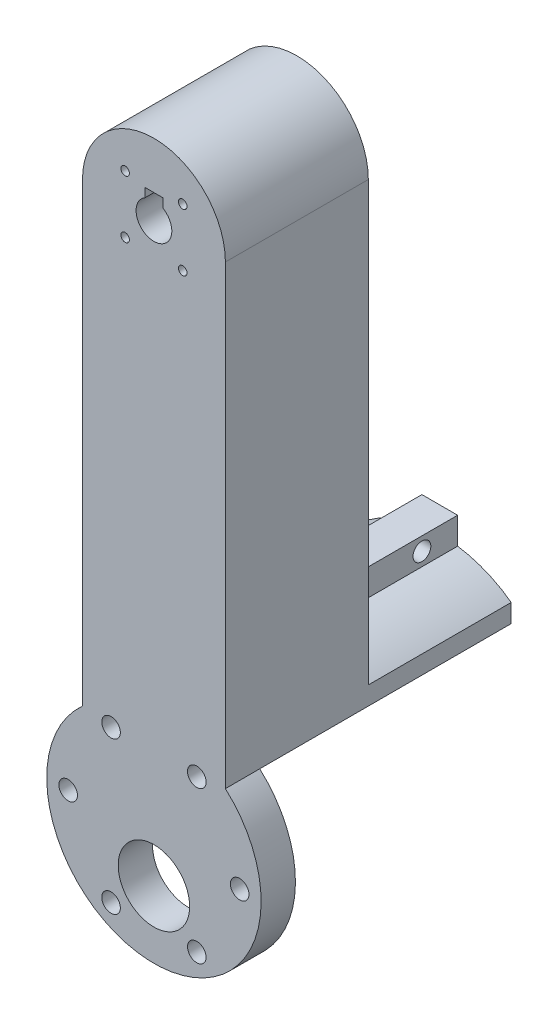
ISO-10303-21;
HEADER;
FILE_DESCRIPTION(('STEP AP214'),'2;1');
FILE_NAME('part.step','',(''),(''),'','','');
FILE_SCHEMA(('AUTOMOTIVE_DESIGN { 1 0 10303 214 1 1 1 1 }'));
ENDSEC;
DATA;
#1=APPLICATION_CONTEXT('core data for automotive mechanical design processes');
#2=APPLICATION_PROTOCOL_DEFINITION('international standard','automotive_design',2000,#1);
#3=PRODUCT_CONTEXT('',#1,'mechanical');
#4=PRODUCT('Part','Part','',(#3));
#5=PRODUCT_RELATED_PRODUCT_CATEGORY('part','',(#4));
#6=PRODUCT_DEFINITION_FORMATION('','',#4);
#7=PRODUCT_DEFINITION_CONTEXT('part definition',#1,'design');
#8=PRODUCT_DEFINITION('design','',#6,#7);
#9=PRODUCT_DEFINITION_SHAPE('','',#8);
#10=(LENGTH_UNIT() NAMED_UNIT(*) SI_UNIT(.MILLI.,.METRE.));
#11=(NAMED_UNIT(*) PLANE_ANGLE_UNIT() SI_UNIT($,.RADIAN.));
#12=(NAMED_UNIT(*) SI_UNIT($,.STERADIAN.) SOLID_ANGLE_UNIT());
#13=UNCERTAINTY_MEASURE_WITH_UNIT(LENGTH_MEASURE(1.E-05),#10,'distance_accuracy_value','');
#14=(GEOMETRIC_REPRESENTATION_CONTEXT(3) GLOBAL_UNCERTAINTY_ASSIGNED_CONTEXT((#13)) GLOBAL_UNIT_ASSIGNED_CONTEXT((#10,
#11,#12)) REPRESENTATION_CONTEXT('',''));
#15=CARTESIAN_POINT('',(0.,0.,0.));
#16=DIRECTION('',(0.,0.,1.));
#17=DIRECTION('',(1.,0.,0.));
#18=AXIS2_PLACEMENT_3D('',#15,#16,#17);
#19=CARTESIAN_POINT('',(0.,-50.8,0.));
#20=DIRECTION('',(0.,0.,-1.));
#21=DIRECTION('',(-1.,0.,0.));
#22=AXIS2_PLACEMENT_3D('',#19,#20,#21);
#23=PLANE('',#22);
#24=CARTESIAN_POINT('',(0.,50.8,0.));
#25=DIRECTION('',(0.,0.,-1.));
#26=DIRECTION('',(-1.,0.,0.));
#27=AXIS2_PLACEMENT_3D('',#24,#25,#26);
#28=CIRCLE('',#27,3.175);
#29=CARTESIAN_POINT('',(1.5875,53.5496306570156,0.));
#30=VERTEX_POINT('',#29);
#31=CARTESIAN_POINT('',(-1.58750000000002,53.5496306570156,0.));
#32=VERTEX_POINT('',#31);
#33=EDGE_CURVE('E207',#30,#32,#28,.T.);
#34=ORIENTED_EDGE('',*,*,#33,.F.);
#35=DIRECTION('',(0.,-1.,0.));
#36=VECTOR('',#35,1.);
#37=CARTESIAN_POINT('',(1.5875,55.1371306570156,0.));
#38=LINE('',#37,#36);
#39=CARTESIAN_POINT('',(1.5875,55.1371306570156,0.));
#40=VERTEX_POINT('',#39);
#41=EDGE_CURVE('E211',#40,#30,#38,.T.);
#42=ORIENTED_EDGE('',*,*,#41,.F.);
#43=DIRECTION('',(1.,0.,0.));
#44=VECTOR('',#43,1.);
#45=CARTESIAN_POINT('',(1.5875,55.1371306570156,0.));
#46=LINE('',#45,#44);
#47=CARTESIAN_POINT('',(-1.5875,55.1371306570156,0.));
#48=VERTEX_POINT('',#47);
#49=EDGE_CURVE('E216',#48,#40,#46,.T.);
#50=ORIENTED_EDGE('',*,*,#49,.F.);
#51=DIRECTION('',(0.,1.,0.));
#52=VECTOR('',#51,1.);
#53=CARTESIAN_POINT('',(-1.5875,55.1371306570156,0.));
#54=LINE('',#53,#52);
#55=EDGE_CURVE('E225',#32,#48,#54,.T.);
#56=ORIENTED_EDGE('',*,*,#55,.F.);
#57=EDGE_LOOP('',(#34,#42,#50,#56));
#58=FACE_BOUND('',#57,.T.);
#59=CARTESIAN_POINT('',(5.11874598900941,45.6812540109906,0.));
#60=DIRECTION('',(0.,0.,1.));
#61=DIRECTION('',(1.,0.,0.));
#62=AXIS2_PLACEMENT_3D('',#59,#60,#61);
#63=CIRCLE('',#62,0.761999999999999);
#64=CARTESIAN_POINT('',(5.88074598900941,45.6812540109906,0.));
#65=VERTEX_POINT('',#64);
#66=EDGE_CURVE('E270',#65,#65,#63,.T.);
#67=ORIENTED_EDGE('',*,*,#66,.T.);
#68=EDGE_LOOP('',(#67));
#69=FACE_BOUND('',#68,.T.);
#70=CARTESIAN_POINT('',(-5.11874598900943,55.9187459890095,0.));
#71=DIRECTION('',(0.,0.,1.));
#72=DIRECTION('',(1.,0.,0.));
#73=AXIS2_PLACEMENT_3D('',#70,#71,#72);
#74=CIRCLE('',#73,0.761999999999999);
#75=CARTESIAN_POINT('',(-4.35674598900943,55.9187459890095,0.));
#76=VERTEX_POINT('',#75);
#77=EDGE_CURVE('E282',#76,#76,#74,.T.);
#78=ORIENTED_EDGE('',*,*,#77,.T.);
#79=EDGE_LOOP('',(#78));
#80=FACE_BOUND('',#79,.T.);
#81=CARTESIAN_POINT('',(5.11874598900941,55.9187459890095,0.));
#82=DIRECTION('',(0.,0.,1.));
#83=DIRECTION('',(1.,0.,0.));
#84=AXIS2_PLACEMENT_3D('',#81,#82,#83);
#85=CIRCLE('',#84,0.761999999999999);
#86=CARTESIAN_POINT('',(5.88074598900941,55.9187459890095,0.));
#87=VERTEX_POINT('',#86);
#88=EDGE_CURVE('E276',#87,#87,#85,.T.);
#89=ORIENTED_EDGE('',*,*,#88,.T.);
#90=EDGE_LOOP('',(#89));
#91=FACE_BOUND('',#90,.T.);
#92=CARTESIAN_POINT('',(-5.11874598900942,45.6812540109906,0.));
#93=DIRECTION('',(0.,0.,1.));
#94=DIRECTION('',(1.,0.,0.));
#95=AXIS2_PLACEMENT_3D('',#92,#93,#94);
#96=CIRCLE('',#95,0.761999999999999);
#97=CARTESIAN_POINT('',(-4.35674598900942,45.6812540109906,0.));
#98=VERTEX_POINT('',#97);
#99=EDGE_CURVE('E266',#98,#98,#96,.T.);
#100=ORIENTED_EDGE('',*,*,#99,.T.);
#101=EDGE_LOOP('',(#100));
#102=FACE_BOUND('',#101,.T.);
#103=DIRECTION('',(1.,0.,0.));
#104=VECTOR('',#103,1.);
#105=CARTESIAN_POINT('',(3.175,-18.3322319145837,0.));
#106=LINE('',#105,#104);
#107=CARTESIAN_POINT('',(-3.175,-18.3322319145837,0.));
#108=VERTEX_POINT('',#107);
#109=CARTESIAN_POINT('',(3.175,-18.3322319145837,0.));
#110=VERTEX_POINT('',#109);
#111=EDGE_CURVE('E348',#108,#110,#106,.T.);
#112=ORIENTED_EDGE('',*,*,#111,.F.);
#113=DIRECTION('',(0.,1.,0.));
#114=VECTOR('',#113,1.);
#115=CARTESIAN_POINT('',(-3.175,-18.3322319145837,0.));
#116=LINE('',#115,#114);
#117=CARTESIAN_POINT('',(-3.175,-23.0947319145837,0.));
#118=VERTEX_POINT('',#117);
#119=EDGE_CURVE('E156',#118,#108,#116,.T.);
#120=ORIENTED_EDGE('',*,*,#119,.F.);
#121=CARTESIAN_POINT('',(0.,-44.45,0.));
#122=DIRECTION('',(0.,0.,-1.));
#123=DIRECTION('',(1.,0.,0.));
#124=AXIS2_PLACEMENT_3D('',#121,#122,#123);
#125=CIRCLE('',#124,21.59);
#126=CARTESIAN_POINT('',(-12.7,-26.9903866022182,0.));
#127=VERTEX_POINT('',#126);
#128=EDGE_CURVE('E64',#127,#118,#125,.T.);
#129=ORIENTED_EDGE('',*,*,#128,.F.);
#130=DIRECTION('',(0.,-1.,0.));
#131=VECTOR('',#130,1.);
#132=CARTESIAN_POINT('',(-12.7,50.8,0.));
#133=LINE('',#132,#131);
#134=CARTESIAN_POINT('',(-12.7,50.8,0.));
#135=VERTEX_POINT('',#134);
#136=EDGE_CURVE('E293',#135,#127,#133,.T.);
#137=ORIENTED_EDGE('',*,*,#136,.F.);
#138=CARTESIAN_POINT('',(0.,50.8,0.));
#139=DIRECTION('',(0.,0.,1.));
#140=DIRECTION('',(-1.,0.,0.));
#141=AXIS2_PLACEMENT_3D('',#138,#139,#140);
#142=CIRCLE('',#141,12.7);
#143=CARTESIAN_POINT('',(12.7,50.8,0.));
#144=VERTEX_POINT('',#143);
#145=EDGE_CURVE('E300',#144,#135,#142,.T.);
#146=ORIENTED_EDGE('',*,*,#145,.F.);
#147=DIRECTION('',(0.,1.,0.));
#148=VECTOR('',#147,1.);
#149=CARTESIAN_POINT('',(12.7,50.8,0.));
#150=LINE('',#149,#148);
#151=CARTESIAN_POINT('',(12.7,-26.9903866022182,0.));
#152=VERTEX_POINT('',#151);
#153=EDGE_CURVE('E170',#152,#144,#150,.T.);
#154=ORIENTED_EDGE('',*,*,#153,.F.);
#155=CARTESIAN_POINT('',(3.175,-23.0947319145837,0.));
#156=VERTEX_POINT('',#155);
#157=EDGE_CURVE('E163',#156,#152,#125,.T.);
#158=ORIENTED_EDGE('',*,*,#157,.F.);
#159=DIRECTION('',(0.,-1.,0.));
#160=VECTOR('',#159,1.);
#161=CARTESIAN_POINT('',(3.175,-18.3322319145837,0.));
#162=LINE('',#161,#160);
#163=EDGE_CURVE('E149',#110,#156,#162,.T.);
#164=ORIENTED_EDGE('',*,*,#163,.F.);
#165=EDGE_LOOP('',(#112,#120,#129,#137,#146,#154,#158,#164));
#166=FACE_BOUND('',#165,.T.);
#167=ADVANCED_FACE('F40',(#58,#69,#80,#91,#102,#166),#23,.T.);
#168=CARTESIAN_POINT('',(0.,-44.45,-25.4));
#169=DIRECTION('',(0.,0.,1.));
#170=DIRECTION('',(1.,0.,0.));
#171=AXIS2_PLACEMENT_3D('',#168,#169,#170);
#172=CYLINDRICAL_SURFACE('',#171,21.59);
#173=DIRECTION('',(0.,0.,1.));
#174=VECTOR('',#173,1.);
#175=CARTESIAN_POINT('',(-3.175,-23.0947319145837,-33.3375));
#176=LINE('',#175,#174);
#177=CARTESIAN_POINT('',(-3.175,-23.0947319145837,-25.4));
#178=VERTEX_POINT('',#177);
#179=EDGE_CURVE('E167',#178,#118,#176,.T.);
#180=ORIENTED_EDGE('',*,*,#179,.F.);
#181=CARTESIAN_POINT('',(0.,-44.45,-25.4));
#182=DIRECTION('',(0.,0.,-1.));
#183=DIRECTION('',(1.,0.,0.));
#184=AXIS2_PLACEMENT_3D('',#181,#182,#183);
#185=CIRCLE('',#184,21.59);
#186=CARTESIAN_POINT('',(-12.7,-26.9903866022182,-25.4));
#187=VERTEX_POINT('',#186);
#188=EDGE_CURVE('E335',#187,#178,#185,.T.);
#189=ORIENTED_EDGE('',*,*,#188,.F.);
#190=DIRECTION('',(0.,0.,1.));
#191=VECTOR('',#190,1.);
#192=CARTESIAN_POINT('',(-12.7,-26.9903866022182,-25.4));
#193=LINE('',#192,#191);
#194=EDGE_CURVE('E183',#187,#127,#193,.T.);
#195=ORIENTED_EDGE('',*,*,#194,.T.);
#196=ORIENTED_EDGE('',*,*,#128,.T.);
#197=EDGE_LOOP('',(#180,#189,#195,#196));
#198=FACE_BOUND('',#197,.T.);
#199=ADVANCED_FACE('F333',(#198),#172,.T.);
#200=DIRECTION('',(0.,0.,1.));
#201=VECTOR('',#200,1.);
#202=CARTESIAN_POINT('',(3.175,-23.0947319145837,-33.3375));
#203=LINE('',#202,#201);
#204=CARTESIAN_POINT('',(3.175,-23.0947319145837,-25.4));
#205=VERTEX_POINT('',#204);
#206=EDGE_CURVE('E56',#205,#156,#203,.T.);
#207=ORIENTED_EDGE('',*,*,#206,.T.);
#208=ORIENTED_EDGE('',*,*,#157,.T.);
#209=DIRECTION('',(0.,0.,1.));
#210=VECTOR('',#209,1.);
#211=CARTESIAN_POINT('',(12.7,-26.9903866022182,-25.4));
#212=LINE('',#211,#210);
#213=CARTESIAN_POINT('',(12.7,-26.9903866022182,-25.4));
#214=VERTEX_POINT('',#213);
#215=EDGE_CURVE('E181',#214,#152,#212,.T.);
#216=ORIENTED_EDGE('',*,*,#215,.F.);
#217=EDGE_CURVE('E165',#205,#214,#185,.T.);
#218=ORIENTED_EDGE('',*,*,#217,.F.);
#219=EDGE_LOOP('',(#207,#208,#216,#218));
#220=FACE_BOUND('',#219,.T.);
#221=ADVANCED_FACE('F161',(#220),#172,.T.);
#222=CARTESIAN_POINT('',(0.,-44.45,25.4));
#223=DIRECTION('',(0.,0.,-1.));
#224=DIRECTION('',(-1.,0.,0.));
#225=AXIS2_PLACEMENT_3D('',#222,#223,#224);
#226=CYLINDRICAL_SURFACE('',#225,19.05);
#227=DIRECTION('',(0.,0.,-1.));
#228=VECTOR('',#227,1.);
#229=CARTESIAN_POINT('',(-12.7,-30.2509683428763,25.4));
#230=LINE('',#229,#228);
#231=CARTESIAN_POINT('',(-12.7,-30.2509683428763,19.3));
#232=VERTEX_POINT('',#231);
#233=CARTESIAN_POINT('',(-12.7,-30.2509683428763,25.4));
#234=VERTEX_POINT('',#233);
#235=EDGE_CURVE('E49',#232,#234,#230,.F.);
#236=ORIENTED_EDGE('',*,*,#235,.F.);
#237=CARTESIAN_POINT('',(0.,-44.45,19.3));
#238=DIRECTION('',(0.,0.,-1.));
#239=DIRECTION('',(-1.,0.,0.));
#240=AXIS2_PLACEMENT_3D('',#237,#238,#239);
#241=CIRCLE('',#240,19.05);
#242=CARTESIAN_POINT('',(12.7,-30.2509683428763,19.3));
#243=VERTEX_POINT('',#242);
#244=EDGE_CURVE('E186',#243,#232,#241,.T.);
#245=ORIENTED_EDGE('',*,*,#244,.F.);
#246=DIRECTION('',(0.,0.,-1.));
#247=VECTOR('',#246,1.);
#248=CARTESIAN_POINT('',(12.7,-30.2509683428763,25.4));
#249=LINE('',#248,#247);
#250=CARTESIAN_POINT('',(12.7,-30.2509683428763,25.4));
#251=VERTEX_POINT('',#250);
#252=EDGE_CURVE('E263',#251,#243,#249,.T.);
#253=ORIENTED_EDGE('',*,*,#252,.F.);
#254=CARTESIAN_POINT('',(0.,-44.45,25.4));
#255=DIRECTION('',(0.,0.,-1.));
#256=DIRECTION('',(-1.,0.,0.));
#257=AXIS2_PLACEMENT_3D('',#254,#255,#256);
#258=CIRCLE('',#257,19.05);
#259=EDGE_CURVE('E259',#251,#234,#258,.T.);
#260=ORIENTED_EDGE('',*,*,#259,.T.);
#261=EDGE_LOOP('',(#236,#245,#253,#260));
#262=FACE_BOUND('',#261,.T.);
#263=ADVANCED_FACE('F323',(#262),#226,.T.);
#264=CARTESIAN_POINT('',(7.62000000000001,-30.9592759275122,0.));
#265=DIRECTION('',(0.,0.,1.));
#266=DIRECTION('',(1.,0.,0.));
#267=AXIS2_PLACEMENT_3D('',#264,#265,#266);
#268=CYLINDRICAL_SURFACE('',#267,1.651);
#269=CARTESIAN_POINT('',(7.62000000000001,-30.9592759275122,25.4));
#270=DIRECTION('',(0.,0.,1.));
#271=DIRECTION('',(1.,0.,0.));
#272=AXIS2_PLACEMENT_3D('',#269,#270,#271);
#273=CIRCLE('',#272,1.651);
#274=CARTESIAN_POINT('',(9.271,-30.9592759275122,25.4));
#275=VERTEX_POINT('',#274);
#276=EDGE_CURVE('E245',#275,#275,#273,.T.);
#277=ORIENTED_EDGE('',*,*,#276,.T.);
#278=EDGE_LOOP('',(#277));
#279=FACE_BOUND('',#278,.T.);
#280=CARTESIAN_POINT('',(7.62000000000001,-30.9592759275122,19.3));
#281=DIRECTION('',(0.,0.,-1.));
#282=DIRECTION('',(-1.,0.,0.));
#283=AXIS2_PLACEMENT_3D('',#280,#281,#282);
#284=CIRCLE('',#283,1.651);
#285=CARTESIAN_POINT('',(5.96900000000001,-30.9592759275122,19.3));
#286=VERTEX_POINT('',#285);
#287=EDGE_CURVE('E204',#286,#286,#284,.F.);
#288=ORIENTED_EDGE('',*,*,#287,.F.);
#289=EDGE_LOOP('',(#288));
#290=FACE_BOUND('',#289,.T.);
#291=ADVANCED_FACE('F412',(#279,#290),#268,.F.);
#292=CARTESIAN_POINT('',(-15.24,-44.45,0.));
#293=DIRECTION('',(0.,0.,1.));
#294=DIRECTION('',(1.,0.,0.));
#295=AXIS2_PLACEMENT_3D('',#292,#293,#294);
#296=CYLINDRICAL_SURFACE('',#295,1.651);
#297=CARTESIAN_POINT('',(-15.24,-44.45,25.4));
#298=DIRECTION('',(0.,0.,1.));
#299=DIRECTION('',(1.,0.,0.));
#300=AXIS2_PLACEMENT_3D('',#297,#298,#299);
#301=CIRCLE('',#300,1.651);
#302=CARTESIAN_POINT('',(-13.589,-44.45,25.4));
#303=VERTEX_POINT('',#302);
#304=EDGE_CURVE('E242',#303,#303,#301,.T.);
#305=ORIENTED_EDGE('',*,*,#304,.T.);
#306=EDGE_LOOP('',(#305));
#307=FACE_BOUND('',#306,.T.);
#308=CARTESIAN_POINT('',(-15.24,-44.45,19.3));
#309=DIRECTION('',(0.,0.,-1.));
#310=DIRECTION('',(-1.,0.,0.));
#311=AXIS2_PLACEMENT_3D('',#308,#309,#310);
#312=CIRCLE('',#311,1.651);
#313=CARTESIAN_POINT('',(-16.891,-44.45,19.3));
#314=VERTEX_POINT('',#313);
#315=EDGE_CURVE('E201',#314,#314,#312,.F.);
#316=ORIENTED_EDGE('',*,*,#315,.F.);
#317=EDGE_LOOP('',(#316));
#318=FACE_BOUND('',#317,.T.);
#319=ADVANCED_FACE('F414',(#307,#318),#296,.F.);
#320=CARTESIAN_POINT('',(-7.61999999999999,-57.9407240724877,0.));
#321=DIRECTION('',(0.,0.,1.));
#322=DIRECTION('',(1.,0.,0.));
#323=AXIS2_PLACEMENT_3D('',#320,#321,#322);
#324=CYLINDRICAL_SURFACE('',#323,1.651);
#325=CARTESIAN_POINT('',(-7.61999999999999,-57.9407240724877,25.4));
#326=DIRECTION('',(0.,0.,1.));
#327=DIRECTION('',(1.,0.,0.));
#328=AXIS2_PLACEMENT_3D('',#325,#326,#327);
#329=CIRCLE('',#328,1.651);
#330=CARTESIAN_POINT('',(-5.96899999999999,-57.9407240724877,25.4));
#331=VERTEX_POINT('',#330);
#332=EDGE_CURVE('E246',#331,#331,#329,.T.);
#333=ORIENTED_EDGE('',*,*,#332,.T.);
#334=EDGE_LOOP('',(#333));
#335=FACE_BOUND('',#334,.T.);
#336=CARTESIAN_POINT('',(-7.61999999999999,-57.9407240724877,19.3));
#337=DIRECTION('',(0.,0.,-1.));
#338=DIRECTION('',(-1.,0.,0.));
#339=AXIS2_PLACEMENT_3D('',#336,#337,#338);
#340=CIRCLE('',#339,1.651);
#341=CARTESIAN_POINT('',(-9.27099999999999,-57.9407240724877,19.3));
#342=VERTEX_POINT('',#341);
#343=EDGE_CURVE('E198',#342,#342,#340,.F.);
#344=ORIENTED_EDGE('',*,*,#343,.F.);
#345=EDGE_LOOP('',(#344));
#346=FACE_BOUND('',#345,.T.);
#347=ADVANCED_FACE('F421',(#335,#346),#324,.F.);
#348=CARTESIAN_POINT('',(7.62,-57.9407240724877,0.));
#349=DIRECTION('',(0.,0.,1.));
#350=DIRECTION('',(1.,0.,0.));
#351=AXIS2_PLACEMENT_3D('',#348,#349,#350);
#352=CYLINDRICAL_SURFACE('',#351,1.651);
#353=CARTESIAN_POINT('',(7.62,-57.9407240724877,25.4));
#354=DIRECTION('',(0.,0.,1.));
#355=DIRECTION('',(1.,0.,0.));
#356=AXIS2_PLACEMENT_3D('',#353,#354,#355);
#357=CIRCLE('',#356,1.651);
#358=CARTESIAN_POINT('',(9.271,-57.9407240724877,25.4));
#359=VERTEX_POINT('',#358);
#360=EDGE_CURVE('E249',#359,#359,#357,.T.);
#361=ORIENTED_EDGE('',*,*,#360,.T.);
#362=EDGE_LOOP('',(#361));
#363=FACE_BOUND('',#362,.T.);
#364=CARTESIAN_POINT('',(7.62,-57.9407240724877,19.3));
#365=DIRECTION('',(0.,0.,-1.));
#366=DIRECTION('',(-1.,0.,0.));
#367=AXIS2_PLACEMENT_3D('',#364,#365,#366);
#368=CIRCLE('',#367,1.651);
#369=CARTESIAN_POINT('',(5.96900000000001,-57.9407240724877,19.3));
#370=VERTEX_POINT('',#369);
#371=EDGE_CURVE('E195',#370,#370,#368,.F.);
#372=ORIENTED_EDGE('',*,*,#371,.F.);
#373=EDGE_LOOP('',(#372));
#374=FACE_BOUND('',#373,.T.);
#375=ADVANCED_FACE('F475',(#363,#374),#352,.F.);
#376=CARTESIAN_POINT('',(15.24,-44.45,0.));
#377=DIRECTION('',(0.,0.,1.));
#378=DIRECTION('',(1.,0.,0.));
#379=AXIS2_PLACEMENT_3D('',#376,#377,#378);
#380=CYLINDRICAL_SURFACE('',#379,1.651);
#381=CARTESIAN_POINT('',(15.24,-44.45,25.4));
#382=DIRECTION('',(0.,0.,1.));
#383=DIRECTION('',(1.,0.,0.));
#384=AXIS2_PLACEMENT_3D('',#381,#382,#383);
#385=CIRCLE('',#384,1.651);
#386=CARTESIAN_POINT('',(16.891,-44.45,25.4));
#387=VERTEX_POINT('',#386);
#388=EDGE_CURVE('E252',#387,#387,#385,.T.);
#389=ORIENTED_EDGE('',*,*,#388,.T.);
#390=EDGE_LOOP('',(#389));
#391=FACE_BOUND('',#390,.T.);
#392=CARTESIAN_POINT('',(15.24,-44.45,19.3));
#393=DIRECTION('',(0.,0.,-1.));
#394=DIRECTION('',(-1.,0.,0.));
#395=AXIS2_PLACEMENT_3D('',#392,#393,#394);
#396=CIRCLE('',#395,1.651);
#397=CARTESIAN_POINT('',(13.589,-44.45,19.3));
#398=VERTEX_POINT('',#397);
#399=EDGE_CURVE('E192',#398,#398,#396,.F.);
#400=ORIENTED_EDGE('',*,*,#399,.F.);
#401=EDGE_LOOP('',(#400));
#402=FACE_BOUND('',#401,.T.);
#403=ADVANCED_FACE('F480',(#391,#402),#380,.F.);
#404=CARTESIAN_POINT('',(-7.61999999999999,-30.9592759275122,0.));
#405=DIRECTION('',(0.,0.,1.));
#406=DIRECTION('',(1.,0.,0.));
#407=AXIS2_PLACEMENT_3D('',#404,#405,#406);
#408=CYLINDRICAL_SURFACE('',#407,1.651);
#409=CARTESIAN_POINT('',(-7.61999999999999,-30.9592759275122,25.4));
#410=DIRECTION('',(0.,0.,1.));
#411=DIRECTION('',(1.,0.,0.));
#412=AXIS2_PLACEMENT_3D('',#409,#410,#411);
#413=CIRCLE('',#412,1.651);
#414=CARTESIAN_POINT('',(-5.96899999999999,-30.9592759275122,25.4));
#415=VERTEX_POINT('',#414);
#416=EDGE_CURVE('E241',#415,#415,#413,.T.);
#417=ORIENTED_EDGE('',*,*,#416,.T.);
#418=EDGE_LOOP('',(#417));
#419=FACE_BOUND('',#418,.T.);
#420=CARTESIAN_POINT('',(-7.61999999999999,-30.9592759275122,19.3));
#421=DIRECTION('',(0.,0.,-1.));
#422=DIRECTION('',(-1.,0.,0.));
#423=AXIS2_PLACEMENT_3D('',#420,#421,#422);
#424=CIRCLE('',#423,1.651);
#425=CARTESIAN_POINT('',(-9.27099999999999,-30.9592759275122,19.3));
#426=VERTEX_POINT('',#425);
#427=EDGE_CURVE('E189',#426,#426,#424,.F.);
#428=ORIENTED_EDGE('',*,*,#427,.F.);
#429=EDGE_LOOP('',(#428));
#430=FACE_BOUND('',#429,.T.);
#431=ADVANCED_FACE('F452',(#419,#430),#408,.F.);
#432=CARTESIAN_POINT('',(0.,-51.562,0.));
#433=DIRECTION('',(0.,0.,1.));
#434=DIRECTION('',(1.,0.,0.));
#435=AXIS2_PLACEMENT_3D('',#432,#433,#434);
#436=CYLINDRICAL_SURFACE('',#435,6.35);
#437=CARTESIAN_POINT('',(0.,-51.562,25.4));
#438=DIRECTION('',(0.,0.,1.));
#439=DIRECTION('',(1.,0.,0.));
#440=AXIS2_PLACEMENT_3D('',#437,#438,#439);
#441=CIRCLE('',#440,6.35);
#442=CARTESIAN_POINT('',(6.35,-51.562,25.4));
#443=VERTEX_POINT('',#442);
#444=EDGE_CURVE('E232',#443,#443,#441,.T.);
#445=ORIENTED_EDGE('',*,*,#444,.T.);
#446=EDGE_LOOP('',(#445));
#447=FACE_BOUND('',#446,.T.);
#448=CARTESIAN_POINT('',(0.,-51.562,19.3));
#449=DIRECTION('',(0.,0.,-1.));
#450=DIRECTION('',(-1.,0.,0.));
#451=AXIS2_PLACEMENT_3D('',#448,#449,#450);
#452=CIRCLE('',#451,6.35);
#453=CARTESIAN_POINT('',(-6.35,-51.562,19.3));
#454=VERTEX_POINT('',#453);
#455=EDGE_CURVE('E44',#454,#454,#452,.F.);
#456=ORIENTED_EDGE('',*,*,#455,.F.);
#457=EDGE_LOOP('',(#456));
#458=FACE_BOUND('',#457,.T.);
#459=ADVANCED_FACE('F447',(#447,#458),#436,.F.);
#460=CARTESIAN_POINT('',(0.,-50.8,25.4));
#461=DIRECTION('',(0.,0.,-1.));
#462=DIRECTION('',(-1.,0.,0.));
#463=AXIS2_PLACEMENT_3D('',#460,#461,#462);
#464=PLANE('',#463);
#465=DIRECTION('',(0.,-1.,0.));
#466=VECTOR('',#465,1.);
#467=CARTESIAN_POINT('',(1.5875,55.1371306570156,25.4));
#468=LINE('',#467,#466);
#469=CARTESIAN_POINT('',(1.5875,55.1371306570156,25.4));
#470=VERTEX_POINT('',#469);
#471=CARTESIAN_POINT('',(1.5875,53.5496306570156,25.4));
#472=VERTEX_POINT('',#471);
#473=EDGE_CURVE('E212',#470,#472,#468,.T.);
#474=ORIENTED_EDGE('',*,*,#473,.T.);
#475=CARTESIAN_POINT('',(0.,50.8,25.4));
#476=DIRECTION('',(0.,0.,-1.));
#477=DIRECTION('',(-1.,0.,0.));
#478=AXIS2_PLACEMENT_3D('',#475,#476,#477);
#479=CIRCLE('',#478,3.175);
#480=CARTESIAN_POINT('',(-1.58750000000002,53.5496306570156,25.4));
#481=VERTEX_POINT('',#480);
#482=EDGE_CURVE('E209',#481,#472,#479,.F.);
#483=ORIENTED_EDGE('',*,*,#482,.F.);
#484=DIRECTION('',(0.,1.,0.));
#485=VECTOR('',#484,1.);
#486=CARTESIAN_POINT('',(-1.5875,55.1371306570156,25.4));
#487=LINE('',#486,#485);
#488=CARTESIAN_POINT('',(-1.5875,55.1371306570156,25.4));
#489=VERTEX_POINT('',#488);
#490=EDGE_CURVE('E215',#481,#489,#487,.T.);
#491=ORIENTED_EDGE('',*,*,#490,.T.);
#492=DIRECTION('',(1.,0.,0.));
#493=VECTOR('',#492,1.);
#494=CARTESIAN_POINT('',(1.5875,55.1371306570156,25.4));
#495=LINE('',#494,#493);
#496=EDGE_CURVE('E219',#489,#470,#495,.T.);
#497=ORIENTED_EDGE('',*,*,#496,.T.);
#498=EDGE_LOOP('',(#474,#483,#491,#497));
#499=FACE_BOUND('',#498,.T.);
#500=ORIENTED_EDGE('',*,*,#444,.F.);
#501=EDGE_LOOP('',(#500));
#502=FACE_BOUND('',#501,.T.);
#503=ORIENTED_EDGE('',*,*,#416,.F.);
#504=EDGE_LOOP('',(#503));
#505=FACE_BOUND('',#504,.T.);
#506=ORIENTED_EDGE('',*,*,#388,.F.);
#507=EDGE_LOOP('',(#506));
#508=FACE_BOUND('',#507,.T.);
#509=ORIENTED_EDGE('',*,*,#360,.F.);
#510=EDGE_LOOP('',(#509));
#511=FACE_BOUND('',#510,.T.);
#512=ORIENTED_EDGE('',*,*,#332,.F.);
#513=EDGE_LOOP('',(#512));
#514=FACE_BOUND('',#513,.T.);
#515=ORIENTED_EDGE('',*,*,#304,.F.);
#516=EDGE_LOOP('',(#515));
#517=FACE_BOUND('',#516,.T.);
#518=ORIENTED_EDGE('',*,*,#276,.F.);
#519=EDGE_LOOP('',(#518));
#520=FACE_BOUND('',#519,.T.);
#521=DIRECTION('',(0.,-1.,0.));
#522=VECTOR('',#521,1.);
#523=CARTESIAN_POINT('',(-12.7,50.8,25.4));
#524=LINE('',#523,#522);
#525=CARTESIAN_POINT('',(-12.7,50.8,25.4));
#526=VERTEX_POINT('',#525);
#527=EDGE_CURVE('E295',#526,#234,#524,.T.);
#528=ORIENTED_EDGE('',*,*,#527,.T.);
#529=ORIENTED_EDGE('',*,*,#259,.F.);
#530=DIRECTION('',(0.,1.,0.));
#531=VECTOR('',#530,1.);
#532=CARTESIAN_POINT('',(12.7,50.8,25.4));
#533=LINE('',#532,#531);
#534=CARTESIAN_POINT('',(12.7,50.8,25.4));
#535=VERTEX_POINT('',#534);
#536=EDGE_CURVE('E290',#251,#535,#533,.T.);
#537=ORIENTED_EDGE('',*,*,#536,.T.);
#538=CARTESIAN_POINT('',(0.,50.8,25.4));
#539=DIRECTION('',(0.,0.,1.));
#540=DIRECTION('',(-1.,0.,0.));
#541=AXIS2_PLACEMENT_3D('',#538,#539,#540);
#542=CIRCLE('',#541,12.7);
#543=EDGE_CURVE('E292',#535,#526,#542,.T.);
#544=ORIENTED_EDGE('',*,*,#543,.T.);
#545=EDGE_LOOP('',(#528,#529,#537,#544));
#546=FACE_BOUND('',#545,.T.);
#547=CARTESIAN_POINT('',(-5.11874598900943,55.9187459890095,25.4));
#548=DIRECTION('',(0.,0.,1.));
#549=DIRECTION('',(1.,0.,0.));
#550=AXIS2_PLACEMENT_3D('',#547,#548,#549);
#551=CIRCLE('',#550,0.761999999999999);
#552=CARTESIAN_POINT('',(-4.35674598900943,55.9187459890095,25.4));
#553=VERTEX_POINT('',#552);
#554=EDGE_CURVE('E285',#553,#553,#551,.T.);
#555=ORIENTED_EDGE('',*,*,#554,.F.);
#556=EDGE_LOOP('',(#555));
#557=FACE_BOUND('',#556,.T.);
#558=CARTESIAN_POINT('',(5.11874598900941,55.9187459890095,25.4));
#559=DIRECTION('',(0.,0.,1.));
#560=DIRECTION('',(1.,0.,0.));
#561=AXIS2_PLACEMENT_3D('',#558,#559,#560);
#562=CIRCLE('',#561,0.761999999999999);
#563=CARTESIAN_POINT('',(5.88074598900941,55.9187459890095,25.4));
#564=VERTEX_POINT('',#563);
#565=EDGE_CURVE('E279',#564,#564,#562,.T.);
#566=ORIENTED_EDGE('',*,*,#565,.F.);
#567=EDGE_LOOP('',(#566));
#568=FACE_BOUND('',#567,.T.);
#569=CARTESIAN_POINT('',(5.11874598900941,45.6812540109906,25.4));
#570=DIRECTION('',(0.,0.,1.));
#571=DIRECTION('',(1.,0.,0.));
#572=AXIS2_PLACEMENT_3D('',#569,#570,#571);
#573=CIRCLE('',#572,0.761999999999999);
#574=CARTESIAN_POINT('',(5.88074598900941,45.6812540109906,25.4));
#575=VERTEX_POINT('',#574);
#576=EDGE_CURVE('E273',#575,#575,#573,.T.);
#577=ORIENTED_EDGE('',*,*,#576,.F.);
#578=EDGE_LOOP('',(#577));
#579=FACE_BOUND('',#578,.T.);
#580=CARTESIAN_POINT('',(-5.11874598900942,45.6812540109906,25.4));
#581=DIRECTION('',(0.,0.,1.));
#582=DIRECTION('',(1.,0.,0.));
#583=AXIS2_PLACEMENT_3D('',#580,#581,#582);
#584=CIRCLE('',#583,0.761999999999999);
#585=CARTESIAN_POINT('',(-4.35674598900942,45.6812540109906,25.4));
#586=VERTEX_POINT('',#585);
#587=EDGE_CURVE('E267',#586,#586,#584,.T.);
#588=ORIENTED_EDGE('',*,*,#587,.F.);
#589=EDGE_LOOP('',(#588));
#590=FACE_BOUND('',#589,.T.);
#591=ADVANCED_FACE('F318',(#499,#502,#505,#508,#511,#514,#517,#520,#546,#557,#568,#579,#590),
#464,.F.);
#592=CARTESIAN_POINT('',(12.7,50.8,25.4));
#593=DIRECTION('',(-1.,0.,0.));
#594=DIRECTION('',(0.,-1.,0.));
#595=AXIS2_PLACEMENT_3D('',#592,#593,#594);
#596=PLANE('',#595);
#597=ORIENTED_EDGE('',*,*,#536,.F.);
#598=ORIENTED_EDGE('',*,*,#252,.T.);
#599=CARTESIAN_POINT('',(12.7,-30.2509683428763,-25.4));
#600=VERTEX_POINT('',#599);
#601=EDGE_CURVE('E262',#243,#600,#249,.T.);
#602=ORIENTED_EDGE('',*,*,#601,.T.);
#603=DIRECTION('',(0.,-1.,0.));
#604=VECTOR('',#603,1.);
#605=CARTESIAN_POINT('',(12.7,-30.2509683428763,-25.4));
#606=LINE('',#605,#604);
#607=EDGE_CURVE('E179',#214,#600,#606,.T.);
#608=ORIENTED_EDGE('',*,*,#607,.F.);
#609=ORIENTED_EDGE('',*,*,#215,.T.);
#610=ORIENTED_EDGE('',*,*,#153,.T.);
#611=DIRECTION('',(0.,0.,-1.));
#612=VECTOR('',#611,1.);
#613=CARTESIAN_POINT('',(12.7,50.8,25.4));
#614=LINE('',#613,#612);
#615=EDGE_CURVE('E305',#535,#144,#614,.T.);
#616=ORIENTED_EDGE('',*,*,#615,.F.);
#617=EDGE_LOOP('',(#597,#598,#602,#608,#609,#610,#616));
#618=FACE_BOUND('',#617,.T.);
#619=ADVANCED_FACE('F42',(#618),#596,.F.);
#620=CARTESIAN_POINT('',(0.,50.8,25.4));
#621=DIRECTION('',(0.,0.,-1.));
#622=DIRECTION('',(-1.,0.,0.));
#623=AXIS2_PLACEMENT_3D('',#620,#621,#622);
#624=CYLINDRICAL_SURFACE('',#623,12.7);
#625=ORIENTED_EDGE('',*,*,#145,.T.);
#626=DIRECTION('',(0.,0.,-1.));
#627=VECTOR('',#626,1.);
#628=CARTESIAN_POINT('',(-12.7,50.8,25.4));
#629=LINE('',#628,#627);
#630=EDGE_CURVE('E298',#526,#135,#629,.T.);
#631=ORIENTED_EDGE('',*,*,#630,.F.);
#632=ORIENTED_EDGE('',*,*,#543,.F.);
#633=ORIENTED_EDGE('',*,*,#615,.T.);
#634=EDGE_LOOP('',(#625,#631,#632,#633));
#635=FACE_BOUND('',#634,.T.);
#636=ADVANCED_FACE('F328',(#635),#624,.T.);
#637=CARTESIAN_POINT('',(-12.7,50.8,25.4));
#638=DIRECTION('',(1.,0.,0.));
#639=DIRECTION('',(0.,1.,0.));
#640=AXIS2_PLACEMENT_3D('',#637,#638,#639);
#641=PLANE('',#640);
#642=ORIENTED_EDGE('',*,*,#136,.T.);
#643=ORIENTED_EDGE('',*,*,#194,.F.);
#644=DIRECTION('',(0.,1.,0.));
#645=VECTOR('',#644,1.);
#646=CARTESIAN_POINT('',(-12.7,-30.2509683428763,-25.4));
#647=LINE('',#646,#645);
#648=CARTESIAN_POINT('',(-12.7,-30.2509683428763,-25.4));
#649=VERTEX_POINT('',#648);
#650=EDGE_CURVE('E337',#649,#187,#647,.T.);
#651=ORIENTED_EDGE('',*,*,#650,.F.);
#652=EDGE_CURVE('E11',#649,#232,#230,.F.);
#653=ORIENTED_EDGE('',*,*,#652,.T.);
#654=ORIENTED_EDGE('',*,*,#235,.T.);
#655=ORIENTED_EDGE('',*,*,#527,.F.);
#656=ORIENTED_EDGE('',*,*,#630,.T.);
#657=EDGE_LOOP('',(#642,#643,#651,#653,#654,#655,#656));
#658=FACE_BOUND('',#657,.T.);
#659=ADVANCED_FACE('F313',(#658),#641,.F.);
#660=CARTESIAN_POINT('',(-5.11874598900943,55.9187459890095,25.4));
#661=DIRECTION('',(0.,0.,-1.));
#662=DIRECTION('',(-1.,0.,0.));
#663=AXIS2_PLACEMENT_3D('',#660,#661,#662);
#664=CYLINDRICAL_SURFACE('',#663,0.761999999999999);
#665=ORIENTED_EDGE('',*,*,#554,.T.);
#666=EDGE_LOOP('',(#665));
#667=FACE_BOUND('',#666,.T.);
#668=ORIENTED_EDGE('',*,*,#77,.F.);
#669=EDGE_LOOP('',(#668));
#670=FACE_BOUND('',#669,.T.);
#671=ADVANCED_FACE('F439',(#667,#670),#664,.F.);
#672=CARTESIAN_POINT('',(5.11874598900941,55.9187459890095,25.4));
#673=DIRECTION('',(0.,0.,-1.));
#674=DIRECTION('',(-1.,0.,0.));
#675=AXIS2_PLACEMENT_3D('',#672,#673,#674);
#676=CYLINDRICAL_SURFACE('',#675,0.761999999999999);
#677=ORIENTED_EDGE('',*,*,#565,.T.);
#678=EDGE_LOOP('',(#677));
#679=FACE_BOUND('',#678,.T.);
#680=ORIENTED_EDGE('',*,*,#88,.F.);
#681=EDGE_LOOP('',(#680));
#682=FACE_BOUND('',#681,.T.);
#683=ADVANCED_FACE('F629',(#679,#682),#676,.F.);
#684=CARTESIAN_POINT('',(5.11874598900941,45.6812540109906,25.4));
#685=DIRECTION('',(0.,0.,-1.));
#686=DIRECTION('',(-1.,0.,0.));
#687=AXIS2_PLACEMENT_3D('',#684,#685,#686);
#688=CYLINDRICAL_SURFACE('',#687,0.761999999999999);
#689=ORIENTED_EDGE('',*,*,#576,.T.);
#690=EDGE_LOOP('',(#689));
#691=FACE_BOUND('',#690,.T.);
#692=ORIENTED_EDGE('',*,*,#66,.F.);
#693=EDGE_LOOP('',(#692));
#694=FACE_BOUND('',#693,.T.);
#695=ADVANCED_FACE('F617',(#691,#694),#688,.F.);
#696=CARTESIAN_POINT('',(-5.11874598900942,45.6812540109906,25.4));
#697=DIRECTION('',(0.,0.,-1.));
#698=DIRECTION('',(-1.,0.,0.));
#699=AXIS2_PLACEMENT_3D('',#696,#697,#698);
#700=CYLINDRICAL_SURFACE('',#699,0.761999999999999);
#701=ORIENTED_EDGE('',*,*,#587,.T.);
#702=EDGE_LOOP('',(#701));
#703=FACE_BOUND('',#702,.T.);
#704=ORIENTED_EDGE('',*,*,#99,.F.);
#705=EDGE_LOOP('',(#704));
#706=FACE_BOUND('',#705,.T.);
#707=ADVANCED_FACE('F612',(#703,#706),#700,.F.);
#708=CARTESIAN_POINT('',(1.5875,55.1371306570156,25.4));
#709=DIRECTION('',(1.,0.,0.));
#710=DIRECTION('',(0.,1.,0.));
#711=AXIS2_PLACEMENT_3D('',#708,#709,#710);
#712=PLANE('',#711);
#713=ORIENTED_EDGE('',*,*,#41,.T.);
#714=DIRECTION('',(0.,0.,-1.));
#715=VECTOR('',#714,1.);
#716=CARTESIAN_POINT('',(1.5875,53.5496306570156,25.4));
#717=LINE('',#716,#715);
#718=EDGE_CURVE('E222',#472,#30,#717,.T.);
#719=ORIENTED_EDGE('',*,*,#718,.F.);
#720=ORIENTED_EDGE('',*,*,#473,.F.);
#721=DIRECTION('',(0.,0.,-1.));
#722=VECTOR('',#721,1.);
#723=CARTESIAN_POINT('',(1.5875,55.1371306570156,25.4));
#724=LINE('',#723,#722);
#725=EDGE_CURVE('E230',#470,#40,#724,.T.);
#726=ORIENTED_EDGE('',*,*,#725,.T.);
#727=EDGE_LOOP('',(#713,#719,#720,#726));
#728=FACE_BOUND('',#727,.T.);
#729=ADVANCED_FACE('F606',(#728),#712,.F.);
#730=CARTESIAN_POINT('',(1.5875,55.1371306570156,25.4));
#731=DIRECTION('',(0.,1.,0.));
#732=DIRECTION('',(0.,0.,1.));
#733=AXIS2_PLACEMENT_3D('',#730,#731,#732);
#734=PLANE('',#733);
#735=ORIENTED_EDGE('',*,*,#49,.T.);
#736=ORIENTED_EDGE('',*,*,#725,.F.);
#737=ORIENTED_EDGE('',*,*,#496,.F.);
#738=DIRECTION('',(0.,0.,-1.));
#739=VECTOR('',#738,1.);
#740=CARTESIAN_POINT('',(-1.5875,55.1371306570156,25.4));
#741=LINE('',#740,#739);
#742=EDGE_CURVE('E233',#489,#48,#741,.T.);
#743=ORIENTED_EDGE('',*,*,#742,.T.);
#744=EDGE_LOOP('',(#735,#736,#737,#743));
#745=FACE_BOUND('',#744,.T.);
#746=ADVANCED_FACE('F603',(#745),#734,.F.);
#747=CARTESIAN_POINT('',(-1.5875,55.1371306570156,25.4));
#748=DIRECTION('',(-1.,0.,0.));
#749=DIRECTION('',(0.,-1.,0.));
#750=AXIS2_PLACEMENT_3D('',#747,#748,#749);
#751=PLANE('',#750);
#752=ORIENTED_EDGE('',*,*,#55,.T.);
#753=ORIENTED_EDGE('',*,*,#742,.F.);
#754=ORIENTED_EDGE('',*,*,#490,.F.);
#755=DIRECTION('',(0.,0.,-1.));
#756=VECTOR('',#755,1.);
#757=CARTESIAN_POINT('',(-1.5875,53.5496306570156,25.4));
#758=LINE('',#757,#756);
#759=EDGE_CURVE('E235',#481,#32,#758,.T.);
#760=ORIENTED_EDGE('',*,*,#759,.T.);
#761=EDGE_LOOP('',(#752,#753,#754,#760));
#762=FACE_BOUND('',#761,.T.);
#763=ADVANCED_FACE('F601',(#762),#751,.F.);
#764=CARTESIAN_POINT('',(0.,50.8,34.3802561210691));
#765=DIRECTION('',(0.,0.,-1.));
#766=DIRECTION('',(-1.,0.,0.));
#767=AXIS2_PLACEMENT_3D('',#764,#765,#766);
#768=CYLINDRICAL_SURFACE('',#767,3.175);
#769=ORIENTED_EDGE('',*,*,#482,.T.);
#770=ORIENTED_EDGE('',*,*,#718,.T.);
#771=ORIENTED_EDGE('',*,*,#33,.T.);
#772=ORIENTED_EDGE('',*,*,#759,.F.);
#773=EDGE_LOOP('',(#769,#770,#771,#772));
#774=FACE_BOUND('',#773,.T.);
#775=ADVANCED_FACE('F531',(#774),#768,.F.);
#776=CARTESIAN_POINT('',(0.,-44.45,19.3));
#777=DIRECTION('',(0.,0.,-1.));
#778=DIRECTION('',(-1.,0.,0.));
#779=AXIS2_PLACEMENT_3D('',#776,#777,#778);
#780=CYLINDRICAL_SURFACE('',#779,19.05);
#781=EDGE_CURVE('E187',#232,#243,#241,.T.);
#782=ORIENTED_EDGE('',*,*,#781,.F.);
#783=ORIENTED_EDGE('',*,*,#652,.F.);
#784=CARTESIAN_POINT('',(0.,-44.45,-25.4));
#785=DIRECTION('',(0.,0.,1.));
#786=DIRECTION('',(1.,0.,0.));
#787=AXIS2_PLACEMENT_3D('',#784,#785,#786);
#788=CIRCLE('',#787,19.05);
#789=EDGE_CURVE('E174',#600,#649,#788,.T.);
#790=ORIENTED_EDGE('',*,*,#789,.F.);
#791=ORIENTED_EDGE('',*,*,#601,.F.);
#792=EDGE_LOOP('',(#782,#783,#790,#791));
#793=FACE_BOUND('',#792,.T.);
#794=ADVANCED_FACE('F391',(#793),#780,.F.);
#795=CARTESIAN_POINT('',(0.,0.,19.3));
#796=DIRECTION('',(0.,0.,-1.));
#797=DIRECTION('',(-1.,0.,0.));
#798=AXIS2_PLACEMENT_3D('',#795,#796,#797);
#799=PLANE('',#798);
#800=ORIENTED_EDGE('',*,*,#781,.T.);
#801=ORIENTED_EDGE('',*,*,#244,.T.);
#802=EDGE_LOOP('',(#800,#801));
#803=FACE_BOUND('',#802,.T.);
#804=ORIENTED_EDGE('',*,*,#455,.T.);
#805=EDGE_LOOP('',(#804));
#806=FACE_BOUND('',#805,.T.);
#807=ORIENTED_EDGE('',*,*,#427,.T.);
#808=EDGE_LOOP('',(#807));
#809=FACE_BOUND('',#808,.T.);
#810=ORIENTED_EDGE('',*,*,#399,.T.);
#811=EDGE_LOOP('',(#810));
#812=FACE_BOUND('',#811,.T.);
#813=ORIENTED_EDGE('',*,*,#371,.T.);
#814=EDGE_LOOP('',(#813));
#815=FACE_BOUND('',#814,.T.);
#816=ORIENTED_EDGE('',*,*,#343,.T.);
#817=EDGE_LOOP('',(#816));
#818=FACE_BOUND('',#817,.T.);
#819=ORIENTED_EDGE('',*,*,#315,.T.);
#820=EDGE_LOOP('',(#819));
#821=FACE_BOUND('',#820,.T.);
#822=ORIENTED_EDGE('',*,*,#287,.T.);
#823=EDGE_LOOP('',(#822));
#824=FACE_BOUND('',#823,.T.);
#825=ADVANCED_FACE('F393',(#803,#806,#809,#812,#815,#818,#821,#824),#799,.T.);
#826=CARTESIAN_POINT('',(0.,-44.45,-25.4));
#827=DIRECTION('',(0.,0.,1.));
#828=DIRECTION('',(1.,0.,0.));
#829=AXIS2_PLACEMENT_3D('',#826,#827,#828);
#830=PLANE('',#829);
#831=ORIENTED_EDGE('',*,*,#188,.T.);
#832=DIRECTION('',(0.,-1.,0.));
#833=VECTOR('',#832,1.);
#834=CARTESIAN_POINT('',(-3.175,-18.3322319145837,-25.4));
#835=LINE('',#834,#833);
#836=CARTESIAN_POINT('',(-3.175,-18.3322319145837,-25.4));
#837=VERTEX_POINT('',#836);
#838=EDGE_CURVE('E175',#837,#178,#835,.T.);
#839=ORIENTED_EDGE('',*,*,#838,.F.);
#840=DIRECTION('',(-1.,0.,0.));
#841=VECTOR('',#840,1.);
#842=CARTESIAN_POINT('',(3.175,-18.3322319145837,-25.4));
#843=LINE('',#842,#841);
#844=CARTESIAN_POINT('',(3.175,-18.3322319145837,-25.4));
#845=VERTEX_POINT('',#844);
#846=EDGE_CURVE('E166',#845,#837,#843,.T.);
#847=ORIENTED_EDGE('',*,*,#846,.F.);
#848=DIRECTION('',(0.,1.,0.));
#849=VECTOR('',#848,1.);
#850=CARTESIAN_POINT('',(3.175,-18.3322319145837,-25.4));
#851=LINE('',#850,#849);
#852=EDGE_CURVE('E172',#205,#845,#851,.T.);
#853=ORIENTED_EDGE('',*,*,#852,.F.);
#854=ORIENTED_EDGE('',*,*,#217,.T.);
#855=ORIENTED_EDGE('',*,*,#607,.T.);
#856=ORIENTED_EDGE('',*,*,#789,.T.);
#857=ORIENTED_EDGE('',*,*,#650,.T.);
#858=EDGE_LOOP('',(#831,#839,#847,#853,#854,#855,#856,#857));
#859=FACE_BOUND('',#858,.T.);
#860=ADVANCED_FACE('F387',(#859),#830,.F.);
#861=CARTESIAN_POINT('',(3.175,-18.3322319145837,-33.3375));
#862=DIRECTION('',(0.,-1.,0.));
#863=DIRECTION('',(0.,0.,-1.));
#864=AXIS2_PLACEMENT_3D('',#861,#862,#863);
#865=PLANE('',#864);
#866=DIRECTION('',(0.,0.,1.));
#867=VECTOR('',#866,1.);
#868=CARTESIAN_POINT('',(3.175,-18.3322319145837,-33.3375));
#869=LINE('',#868,#867);
#870=EDGE_CURVE('E152',#845,#110,#869,.T.);
#871=ORIENTED_EDGE('',*,*,#870,.F.);
#872=ORIENTED_EDGE('',*,*,#846,.T.);
#873=DIRECTION('',(0.,0.,1.));
#874=VECTOR('',#873,1.);
#875=CARTESIAN_POINT('',(-3.175,-18.3322319145837,-33.3375));
#876=LINE('',#875,#874);
#877=EDGE_CURVE('E345',#837,#108,#876,.T.);
#878=ORIENTED_EDGE('',*,*,#877,.T.);
#879=ORIENTED_EDGE('',*,*,#111,.T.);
#880=EDGE_LOOP('',(#871,#872,#878,#879));
#881=FACE_BOUND('',#880,.T.);
#882=ADVANCED_FACE('F382',(#881),#865,.F.);
#883=CARTESIAN_POINT('',(-3.175,-18.3322319145837,-33.3375));
#884=DIRECTION('',(1.,0.,0.));
#885=DIRECTION('',(0.,0.,-1.));
#886=AXIS2_PLACEMENT_3D('',#883,#884,#885);
#887=PLANE('',#886);
#888=CARTESIAN_POINT('',(-3.175,-20.7134819145837,-6.35));
#889=DIRECTION('',(1.,0.,0.));
#890=DIRECTION('',(0.,0.,-1.));
#891=AXIS2_PLACEMENT_3D('',#888,#889,#890);
#892=CIRCLE('',#891,1.5875);
#893=CARTESIAN_POINT('',(-3.175,-20.7134819145837,-7.9375));
#894=VERTEX_POINT('',#893);
#895=EDGE_CURVE('E157',#894,#894,#892,.T.);
#896=ORIENTED_EDGE('',*,*,#895,.T.);
#897=EDGE_LOOP('',(#896));
#898=FACE_BOUND('',#897,.T.);
#899=CARTESIAN_POINT('',(-3.175,-20.7134819145837,-19.05));
#900=DIRECTION('',(1.,0.,0.));
#901=DIRECTION('',(0.,0.,-1.));
#902=AXIS2_PLACEMENT_3D('',#899,#900,#901);
#903=CIRCLE('',#902,1.5875);
#904=CARTESIAN_POINT('',(-3.175,-20.7134819145837,-20.6375));
#905=VERTEX_POINT('',#904);
#906=EDGE_CURVE('E355',#905,#905,#903,.T.);
#907=ORIENTED_EDGE('',*,*,#906,.T.);
#908=EDGE_LOOP('',(#907));
#909=FACE_BOUND('',#908,.T.);
#910=ORIENTED_EDGE('',*,*,#877,.F.);
#911=ORIENTED_EDGE('',*,*,#838,.T.);
#912=ORIENTED_EDGE('',*,*,#179,.T.);
#913=ORIENTED_EDGE('',*,*,#119,.T.);
#914=EDGE_LOOP('',(#910,#911,#912,#913));
#915=FACE_BOUND('',#914,.T.);
#916=ADVANCED_FACE('F371',(#898,#909,#915),#887,.F.);
#917=CARTESIAN_POINT('',(3.175,-18.3322319145837,-33.3375));
#918=DIRECTION('',(-1.,0.,0.));
#919=DIRECTION('',(0.,-1.,0.));
#920=AXIS2_PLACEMENT_3D('',#917,#918,#919);
#921=PLANE('',#920);
#922=CARTESIAN_POINT('',(3.175,-20.7134819145837,-6.35));
#923=DIRECTION('',(1.,0.,0.));
#924=DIRECTION('',(0.,1.,0.));
#925=AXIS2_PLACEMENT_3D('',#922,#923,#924);
#926=CIRCLE('',#925,1.5875);
#927=CARTESIAN_POINT('',(3.175,-19.1259819145837,-6.35));
#928=VERTEX_POINT('',#927);
#929=EDGE_CURVE('E358',#928,#928,#926,.T.);
#930=ORIENTED_EDGE('',*,*,#929,.F.);
#931=EDGE_LOOP('',(#930));
#932=FACE_BOUND('',#931,.T.);
#933=CARTESIAN_POINT('',(3.175,-20.7134819145837,-19.05));
#934=DIRECTION('',(1.,0.,0.));
#935=DIRECTION('',(0.,1.,0.));
#936=AXIS2_PLACEMENT_3D('',#933,#934,#935);
#937=CIRCLE('',#936,1.5875);
#938=CARTESIAN_POINT('',(3.175,-19.1259819145837,-19.05));
#939=VERTEX_POINT('',#938);
#940=EDGE_CURVE('E359',#939,#939,#937,.T.);
#941=ORIENTED_EDGE('',*,*,#940,.F.);
#942=EDGE_LOOP('',(#941));
#943=FACE_BOUND('',#942,.T.);
#944=ORIENTED_EDGE('',*,*,#206,.F.);
#945=ORIENTED_EDGE('',*,*,#852,.T.);
#946=ORIENTED_EDGE('',*,*,#870,.T.);
#947=ORIENTED_EDGE('',*,*,#163,.T.);
#948=EDGE_LOOP('',(#944,#945,#946,#947));
#949=FACE_BOUND('',#948,.T.);
#950=ADVANCED_FACE('F150',(#932,#943,#949),#921,.F.);
#951=CARTESIAN_POINT('',(-19.05,-20.7134819145837,-19.05));
#952=DIRECTION('',(1.,0.,0.));
#953=DIRECTION('',(0.,1.,0.));
#954=AXIS2_PLACEMENT_3D('',#951,#952,#953);
#955=CYLINDRICAL_SURFACE('',#954,1.5875);
#956=ORIENTED_EDGE('',*,*,#940,.T.);
#957=EDGE_LOOP('',(#956));
#958=FACE_BOUND('',#957,.T.);
#959=ORIENTED_EDGE('',*,*,#906,.F.);
#960=EDGE_LOOP('',(#959));
#961=FACE_BOUND('',#960,.T.);
#962=ADVANCED_FACE('F370',(#958,#961),#955,.F.);
#963=CARTESIAN_POINT('',(-19.05,-20.7134819145837,-6.35));
#964=DIRECTION('',(1.,0.,0.));
#965=DIRECTION('',(0.,1.,0.));
#966=AXIS2_PLACEMENT_3D('',#963,#964,#965);
#967=CYLINDRICAL_SURFACE('',#966,1.5875);
#968=ORIENTED_EDGE('',*,*,#929,.T.);
#969=EDGE_LOOP('',(#968));
#970=FACE_BOUND('',#969,.T.);
#971=ORIENTED_EDGE('',*,*,#895,.F.);
#972=EDGE_LOOP('',(#971));
#973=FACE_BOUND('',#972,.T.);
#974=ADVANCED_FACE('F365',(#970,#973),#967,.F.);
#975=CLOSED_SHELL('',(#167,#199,#221,#263,#291,#319,#347,#375,#403,#431,#459,#591,#619,#636,
#659,#671,#683,#695,#707,#729,#746,#763,#775,#794,#825,#860,#882,#916,#950,#962,#974));
#976=MANIFOLD_SOLID_BREP('B2',#975);
#977=ADVANCED_BREP_SHAPE_REPRESENTATION('',(#18,#976),#14);
#978=SHAPE_DEFINITION_REPRESENTATION(#9,#977);
ENDSEC;
END-ISO-10303-21;
